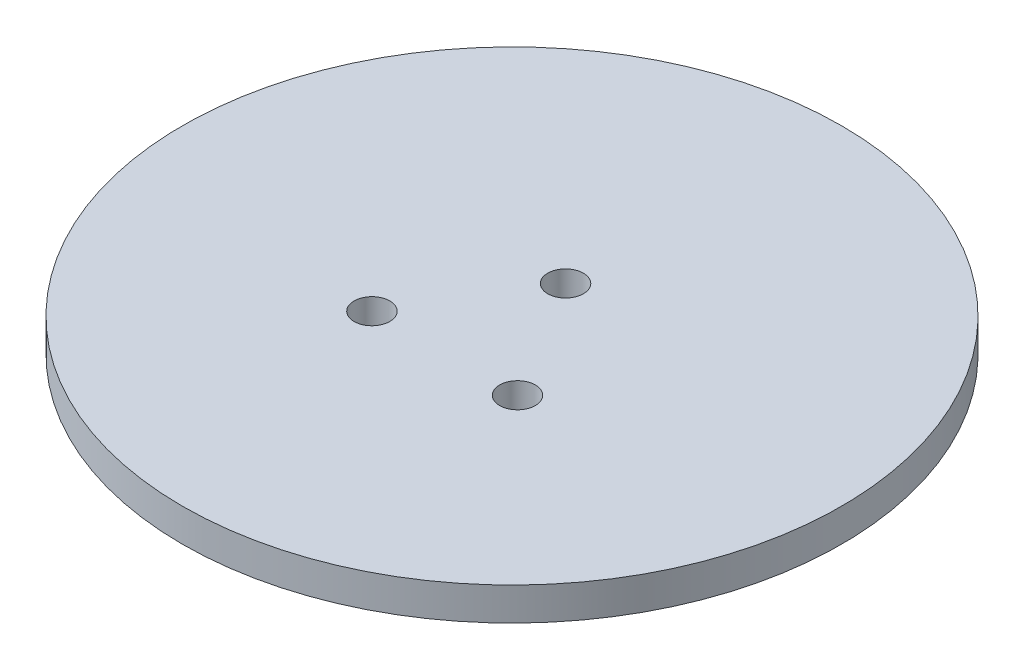
ISO-10303-21;
HEADER;
FILE_DESCRIPTION(('STEP AP214'),'2;1');
FILE_NAME('part.step','',(''),(''),'','','');
FILE_SCHEMA(('AUTOMOTIVE_DESIGN { 1 0 10303 214 1 1 1 1 }'));
ENDSEC;
DATA;
#1=APPLICATION_CONTEXT('core data for automotive mechanical design processes');
#2=APPLICATION_PROTOCOL_DEFINITION('international standard','automotive_design',2000,#1);
#3=PRODUCT_CONTEXT('',#1,'mechanical');
#4=PRODUCT('Part','Part','',(#3));
#5=PRODUCT_RELATED_PRODUCT_CATEGORY('part','',(#4));
#6=PRODUCT_DEFINITION_FORMATION('','',#4);
#7=PRODUCT_DEFINITION_CONTEXT('part definition',#1,'design');
#8=PRODUCT_DEFINITION('design','',#6,#7);
#9=PRODUCT_DEFINITION_SHAPE('','',#8);
#10=(LENGTH_UNIT() NAMED_UNIT(*) SI_UNIT(.MILLI.,.METRE.));
#11=(NAMED_UNIT(*) PLANE_ANGLE_UNIT() SI_UNIT($,.RADIAN.));
#12=(NAMED_UNIT(*) SI_UNIT($,.STERADIAN.) SOLID_ANGLE_UNIT());
#13=UNCERTAINTY_MEASURE_WITH_UNIT(LENGTH_MEASURE(1.E-05),#10,'distance_accuracy_value','');
#14=(GEOMETRIC_REPRESENTATION_CONTEXT(3) GLOBAL_UNCERTAINTY_ASSIGNED_CONTEXT((#13)) GLOBAL_UNIT_ASSIGNED_CONTEXT((#10,
#11,#12)) REPRESENTATION_CONTEXT('',''));
#15=CARTESIAN_POINT('',(0.,0.,0.));
#16=DIRECTION('',(0.,0.,1.));
#17=DIRECTION('',(1.,0.,0.));
#18=AXIS2_PLACEMENT_3D('',#15,#16,#17);
#19=CARTESIAN_POINT('',(0.,6.096,0.));
#20=DIRECTION('',(0.,1.,0.));
#21=DIRECTION('',(0.,0.,1.));
#22=AXIS2_PLACEMENT_3D('',#19,#20,#21);
#23=PLANE('',#22);
#24=CARTESIAN_POINT('',(-13.7160000000005,6.096,12.192));
#25=DIRECTION('',(0.,1.,0.));
#26=DIRECTION('',(0.,0.,1.));
#27=AXIS2_PLACEMENT_3D('',#24,#25,#26);
#28=CIRCLE('',#27,3.302);
#29=CARTESIAN_POINT('',(-13.7160000000005,6.096,15.494));
#30=VERTEX_POINT('',#29);
#31=EDGE_CURVE('E48',#30,#30,#28,.T.);
#32=ORIENTED_EDGE('',*,*,#31,.F.);
#33=EDGE_LOOP('',(#32));
#34=FACE_BOUND('',#33,.T.);
#35=CARTESIAN_POINT('',(0.,6.096,0.));
#36=DIRECTION('',(0.,1.,0.));
#37=DIRECTION('',(0.,0.,1.));
#38=AXIS2_PLACEMENT_3D('',#35,#36,#37);
#39=CIRCLE('',#38,60.96);
#40=CARTESIAN_POINT('',(0.,6.096,60.96));
#41=VERTEX_POINT('',#40);
#42=EDGE_CURVE('E10',#41,#41,#39,.T.);
#43=ORIENTED_EDGE('',*,*,#42,.T.);
#44=EDGE_LOOP('',(#43));
#45=FACE_BOUND('',#44,.T.);
#46=CARTESIAN_POINT('',(-0.254000000000001,6.096,-10.16));
#47=DIRECTION('',(0.,1.,0.));
#48=DIRECTION('',(0.,0.,1.));
#49=AXIS2_PLACEMENT_3D('',#46,#47,#48);
#50=CIRCLE('',#49,3.302);
#51=CARTESIAN_POINT('',(-0.254000000000001,6.096,-6.858));
#52=VERTEX_POINT('',#51);
#53=EDGE_CURVE('E43',#52,#52,#50,.T.);
#54=ORIENTED_EDGE('',*,*,#53,.F.);
#55=EDGE_LOOP('',(#54));
#56=FACE_BOUND('',#55,.T.);
#57=CARTESIAN_POINT('',(13.208,6.096,12.192));
#58=DIRECTION('',(0.,1.,0.));
#59=DIRECTION('',(0.,0.,1.));
#60=AXIS2_PLACEMENT_3D('',#57,#58,#59);
#61=CIRCLE('',#60,3.302);
#62=CARTESIAN_POINT('',(13.208,6.096,15.494));
#63=VERTEX_POINT('',#62);
#64=EDGE_CURVE('E54',#63,#63,#61,.T.);
#65=ORIENTED_EDGE('',*,*,#64,.F.);
#66=EDGE_LOOP('',(#65));
#67=FACE_BOUND('',#66,.T.);
#68=ADVANCED_FACE('F32',(#34,#45,#56,#67),#23,.T.);
#69=CARTESIAN_POINT('',(0.,0.,0.));
#70=DIRECTION('',(0.,1.,0.));
#71=DIRECTION('',(0.,0.,1.));
#72=AXIS2_PLACEMENT_3D('',#69,#70,#71);
#73=PLANE('',#72);
#74=CARTESIAN_POINT('',(-13.7160000000005,0.,12.192));
#75=DIRECTION('',(0.,1.,0.));
#76=DIRECTION('',(0.,0.,1.));
#77=AXIS2_PLACEMENT_3D('',#74,#75,#76);
#78=CIRCLE('',#77,3.302);
#79=CARTESIAN_POINT('',(-13.7160000000005,0.,15.494));
#80=VERTEX_POINT('',#79);
#81=EDGE_CURVE('E51',#80,#80,#78,.T.);
#82=ORIENTED_EDGE('',*,*,#81,.T.);
#83=EDGE_LOOP('',(#82));
#84=FACE_BOUND('',#83,.T.);
#85=CARTESIAN_POINT('',(0.,0.,0.));
#86=DIRECTION('',(0.,1.,0.));
#87=DIRECTION('',(0.,0.,1.));
#88=AXIS2_PLACEMENT_3D('',#85,#86,#87);
#89=CIRCLE('',#88,60.96);
#90=CARTESIAN_POINT('',(0.,0.,60.96));
#91=VERTEX_POINT('',#90);
#92=EDGE_CURVE('E36',#91,#91,#89,.T.);
#93=ORIENTED_EDGE('',*,*,#92,.F.);
#94=EDGE_LOOP('',(#93));
#95=FACE_BOUND('',#94,.T.);
#96=CARTESIAN_POINT('',(-0.254000000000001,0.,-10.16));
#97=DIRECTION('',(0.,1.,0.));
#98=DIRECTION('',(0.,0.,1.));
#99=AXIS2_PLACEMENT_3D('',#96,#97,#98);
#100=CIRCLE('',#99,3.302);
#101=CARTESIAN_POINT('',(-0.254000000000001,0.,-6.858));
#102=VERTEX_POINT('',#101);
#103=EDGE_CURVE('E45',#102,#102,#100,.T.);
#104=ORIENTED_EDGE('',*,*,#103,.T.);
#105=EDGE_LOOP('',(#104));
#106=FACE_BOUND('',#105,.T.);
#107=CARTESIAN_POINT('',(13.208,0.,12.192));
#108=DIRECTION('',(0.,1.,0.));
#109=DIRECTION('',(0.,0.,1.));
#110=AXIS2_PLACEMENT_3D('',#107,#108,#109);
#111=CIRCLE('',#110,3.302);
#112=CARTESIAN_POINT('',(13.208,0.,15.494));
#113=VERTEX_POINT('',#112);
#114=EDGE_CURVE('E57',#113,#113,#111,.T.);
#115=ORIENTED_EDGE('',*,*,#114,.T.);
#116=EDGE_LOOP('',(#115));
#117=FACE_BOUND('',#116,.T.);
#118=ADVANCED_FACE('F67',(#84,#95,#106,#117),#73,.F.);
#119=CARTESIAN_POINT('',(0.,6.096,0.));
#120=DIRECTION('',(0.,-1.,0.));
#121=DIRECTION('',(0.,0.,-1.));
#122=AXIS2_PLACEMENT_3D('',#119,#120,#121);
#123=CYLINDRICAL_SURFACE('',#122,60.96);
#124=ORIENTED_EDGE('',*,*,#42,.F.);
#125=EDGE_LOOP('',(#124));
#126=FACE_BOUND('',#125,.T.);
#127=ORIENTED_EDGE('',*,*,#92,.T.);
#128=EDGE_LOOP('',(#127));
#129=FACE_BOUND('',#128,.T.);
#130=ADVANCED_FACE('F34',(#126,#129),#123,.T.);
#131=CARTESIAN_POINT('',(-0.254000000000001,6.096,-10.16));
#132=DIRECTION('',(0.,-1.,0.));
#133=DIRECTION('',(0.,0.,-1.));
#134=AXIS2_PLACEMENT_3D('',#131,#132,#133);
#135=CYLINDRICAL_SURFACE('',#134,3.302);
#136=ORIENTED_EDGE('',*,*,#53,.T.);
#137=EDGE_LOOP('',(#136));
#138=FACE_BOUND('',#137,.T.);
#139=ORIENTED_EDGE('',*,*,#103,.F.);
#140=EDGE_LOOP('',(#139));
#141=FACE_BOUND('',#140,.T.);
#142=ADVANCED_FACE('F76',(#138,#141),#135,.F.);
#143=CARTESIAN_POINT('',(-13.7160000000005,6.096,12.192));
#144=DIRECTION('',(0.,-1.,0.));
#145=DIRECTION('',(0.,0.,-1.));
#146=AXIS2_PLACEMENT_3D('',#143,#144,#145);
#147=CYLINDRICAL_SURFACE('',#146,3.302);
#148=ORIENTED_EDGE('',*,*,#31,.T.);
#149=EDGE_LOOP('',(#148));
#150=FACE_BOUND('',#149,.T.);
#151=ORIENTED_EDGE('',*,*,#81,.F.);
#152=EDGE_LOOP('',(#151));
#153=FACE_BOUND('',#152,.T.);
#154=ADVANCED_FACE('F79',(#150,#153),#147,.F.);
#155=CARTESIAN_POINT('',(13.208,6.096,12.192));
#156=DIRECTION('',(0.,-1.,0.));
#157=DIRECTION('',(0.,0.,-1.));
#158=AXIS2_PLACEMENT_3D('',#155,#156,#157);
#159=CYLINDRICAL_SURFACE('',#158,3.302);
#160=ORIENTED_EDGE('',*,*,#64,.T.);
#161=EDGE_LOOP('',(#160));
#162=FACE_BOUND('',#161,.T.);
#163=ORIENTED_EDGE('',*,*,#114,.F.);
#164=EDGE_LOOP('',(#163));
#165=FACE_BOUND('',#164,.T.);
#166=ADVANCED_FACE('F63',(#162,#165),#159,.F.);
#167=CLOSED_SHELL('',(#68,#118,#130,#142,#154,#166));
#168=MANIFOLD_SOLID_BREP('B2',#167);
#169=ADVANCED_BREP_SHAPE_REPRESENTATION('',(#18,#168),#14);
#170=SHAPE_DEFINITION_REPRESENTATION(#9,#169);
ENDSEC;
END-ISO-10303-21;
